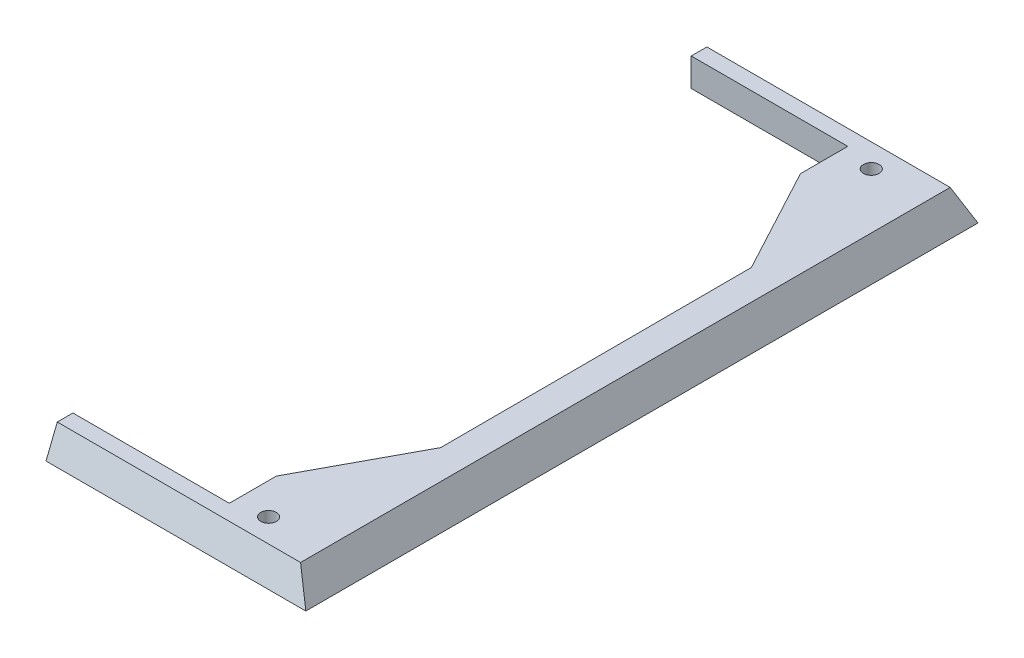
ISO-10303-21;
HEADER;
FILE_DESCRIPTION(('STEP AP214'),'2;1');
FILE_NAME('part.step','',(''),(''),'','','');
FILE_SCHEMA(('AUTOMOTIVE_DESIGN { 1 0 10303 214 1 1 1 1 }'));
ENDSEC;
DATA;
#1=APPLICATION_CONTEXT('core data for automotive mechanical design processes');
#2=APPLICATION_PROTOCOL_DEFINITION('international standard','automotive_design',2000,#1);
#3=PRODUCT_CONTEXT('',#1,'mechanical');
#4=PRODUCT('Part','Part','',(#3));
#5=PRODUCT_RELATED_PRODUCT_CATEGORY('part','',(#4));
#6=PRODUCT_DEFINITION_FORMATION('','',#4);
#7=PRODUCT_DEFINITION_CONTEXT('part definition',#1,'design');
#8=PRODUCT_DEFINITION('design','',#6,#7);
#9=PRODUCT_DEFINITION_SHAPE('','',#8);
#10=(LENGTH_UNIT() NAMED_UNIT(*) SI_UNIT(.MILLI.,.METRE.));
#11=(NAMED_UNIT(*) PLANE_ANGLE_UNIT() SI_UNIT($,.RADIAN.));
#12=(NAMED_UNIT(*) SI_UNIT($,.STERADIAN.) SOLID_ANGLE_UNIT());
#13=UNCERTAINTY_MEASURE_WITH_UNIT(LENGTH_MEASURE(1.E-05),#10,'distance_accuracy_value','');
#14=(GEOMETRIC_REPRESENTATION_CONTEXT(3) GLOBAL_UNCERTAINTY_ASSIGNED_CONTEXT((#13)) GLOBAL_UNIT_ASSIGNED_CONTEXT((#10,
#11,#12)) REPRESENTATION_CONTEXT('',''));
#15=CARTESIAN_POINT('',(0.,0.,0.));
#16=DIRECTION('',(0.,0.,1.));
#17=DIRECTION('',(1.,0.,0.));
#18=AXIS2_PLACEMENT_3D('',#15,#16,#17);
#19=CARTESIAN_POINT('',(12.1850786387237,3.,-36.1277693717595));
#20=DIRECTION('',(1.,0.,0.));
#21=DIRECTION('',(0.,0.,-1.));
#22=AXIS2_PLACEMENT_3D('',#19,#20,#21);
#23=PLANE('',#22);
#24=DIRECTION('',(0.,1.,0.));
#25=VECTOR('',#24,1.);
#26=CARTESIAN_POINT('',(12.1850786387237,15.,-42.1776601239794));
#27=LINE('',#26,#25);
#28=CARTESIAN_POINT('',(12.1850786387237,11.4,-42.1776601239794));
#29=VERTEX_POINT('',#28);
#30=CARTESIAN_POINT('',(12.1850786387237,15.,-42.1776601239794));
#31=VERTEX_POINT('',#30);
#32=EDGE_CURVE('E133',#29,#31,#27,.T.);
#33=ORIENTED_EDGE('',*,*,#32,.F.);
#34=DIRECTION('',(0.,0.,-1.));
#35=VECTOR('',#34,1.);
#36=CARTESIAN_POINT('',(12.1850786387237,11.4,-28.4548897395233));
#37=LINE('',#36,#35);
#38=CARTESIAN_POINT('',(12.1850786387237,11.4,-36.1277693717595));
#39=VERTEX_POINT('',#38);
#40=EDGE_CURVE('E175',#39,#29,#37,.T.);
#41=ORIENTED_EDGE('',*,*,#40,.F.);
#42=DIRECTION('',(0.,1.,0.));
#43=VECTOR('',#42,1.);
#44=CARTESIAN_POINT('',(12.1850786387237,3.,-36.1277693717595));
#45=LINE('',#44,#43);
#46=CARTESIAN_POINT('',(12.1850786387237,15.,-36.1277693717595));
#47=VERTEX_POINT('',#46);
#48=EDGE_CURVE('E182',#39,#47,#45,.T.);
#49=ORIENTED_EDGE('',*,*,#48,.T.);
#50=DIRECTION('',(0.,0.,-1.));
#51=VECTOR('',#50,1.);
#52=CARTESIAN_POINT('',(12.1850786387237,15.,-36.1277693717595));
#53=LINE('',#52,#51);
#54=EDGE_CURVE('E127',#47,#31,#53,.T.);
#55=ORIENTED_EDGE('',*,*,#54,.T.);
#56=EDGE_LOOP('',(#33,#41,#49,#55));
#57=FACE_BOUND('',#56,.T.);
#58=ADVANCED_FACE('F33',(#57),#23,.F.);
#59=CARTESIAN_POINT('',(12.1654237640311,3.,30.8097046992084));
#60=DIRECTION('',(1.,0.,0.));
#61=DIRECTION('',(0.,0.,-1.));
#62=AXIS2_PLACEMENT_3D('',#59,#60,#61);
#63=PLANE('',#62);
#64=DIRECTION('',(0.,0.,-1.));
#65=VECTOR('',#64,1.);
#66=CARTESIAN_POINT('',(12.1654237640311,11.4,23.313034746654));
#67=LINE('',#66,#65);
#68=CARTESIAN_POINT('',(12.1654237640311,11.4,36.8223398760206));
#69=VERTEX_POINT('',#68);
#70=CARTESIAN_POINT('',(12.1654237640311,11.4,30.8097046992084));
#71=VERTEX_POINT('',#70);
#72=EDGE_CURVE('E155',#69,#71,#67,.T.);
#73=ORIENTED_EDGE('',*,*,#72,.F.);
#74=DIRECTION('',(0.,-1.,0.));
#75=VECTOR('',#74,1.);
#76=CARTESIAN_POINT('',(12.1654237640311,15.,36.8223398760206));
#77=LINE('',#76,#75);
#78=CARTESIAN_POINT('',(12.1654237640311,15.,36.8223398760206));
#79=VERTEX_POINT('',#78);
#80=EDGE_CURVE('E139',#79,#69,#77,.T.);
#81=ORIENTED_EDGE('',*,*,#80,.F.);
#82=DIRECTION('',(0.,0.,-1.));
#83=VECTOR('',#82,1.);
#84=CARTESIAN_POINT('',(12.1654237640311,15.,30.8097046992084));
#85=LINE('',#84,#83);
#86=CARTESIAN_POINT('',(12.1654237640311,15.,30.8097046992084));
#87=VERTEX_POINT('',#86);
#88=EDGE_CURVE('E124',#79,#87,#85,.T.);
#89=ORIENTED_EDGE('',*,*,#88,.T.);
#90=DIRECTION('',(0.,1.,0.));
#91=VECTOR('',#90,1.);
#92=CARTESIAN_POINT('',(12.1654237640311,3.,30.8097046992084));
#93=LINE('',#92,#91);
#94=EDGE_CURVE('E101',#71,#87,#93,.T.);
#95=ORIENTED_EDGE('',*,*,#94,.F.);
#96=EDGE_LOOP('',(#73,#81,#89,#95));
#97=FACE_BOUND('',#96,.T.);
#98=ADVANCED_FACE('F221',(#97),#63,.F.);
#99=CARTESIAN_POINT('',(31.4163270772975,1.11973354177883,-55.1776601239794));
#100=DIRECTION('',(-0.862426499786159,-0.506182311491221,0.));
#101=DIRECTION('',(0.506182311491221,-0.862426499786159,0.));
#102=AXIS2_PLACEMENT_3D('',#99,#100,#101);
#103=PLANE('',#102);
#104=DIRECTION('',(0.478509987129761,-0.815278771984898,0.326111508793959));
#105=VECTOR('',#104,1.);
#106=CARTESIAN_POINT('',(15.8814583886596,27.5878303591287,33.7872077323691));
#107=LINE('',#106,#105);
#108=CARTESIAN_POINT('',(23.2696092275114,15.,38.8223398760206));
#109=VERTEX_POINT('',#108);
#110=CARTESIAN_POINT('',(25.3825502396675,11.4,40.2623398760206));
#111=VERTEX_POINT('',#110);
#112=EDGE_CURVE('E136',#109,#111,#107,.T.);
#113=ORIENTED_EDGE('',*,*,#112,.T.);
#114=DIRECTION('',(0.,0.,1.));
#115=VECTOR('',#114,1.);
#116=CARTESIAN_POINT('',(25.3825502396675,11.4,4.82233987602057));
#117=LINE('',#116,#115);
#118=CARTESIAN_POINT('',(25.3825502396675,11.4,-45.6176601239794));
#119=VERTEX_POINT('',#118);
#120=EDGE_CURVE('E50',#119,#111,#117,.T.);
#121=ORIENTED_EDGE('',*,*,#120,.F.);
#122=DIRECTION('',(-0.478509987129761,0.815278771984898,0.326111508793959));
#123=VECTOR('',#122,1.);
#124=CARTESIAN_POINT('',(32.2664578456254,-0.328707634937858,-50.3091431779546));
#125=LINE('',#124,#123);
#126=CARTESIAN_POINT('',(23.2696092275114,15.,-44.1776601239794));
#127=VERTEX_POINT('',#126);
#128=EDGE_CURVE('E126',#119,#127,#125,.T.);
#129=ORIENTED_EDGE('',*,*,#128,.T.);
#130=DIRECTION('',(0.,0.,1.));
#131=VECTOR('',#130,1.);
#132=CARTESIAN_POINT('',(23.2696092275114,15.,-55.1776601239794));
#133=LINE('',#132,#131);
#134=EDGE_CURVE('E149',#127,#109,#133,.T.);
#135=ORIENTED_EDGE('',*,*,#134,.T.);
#136=EDGE_LOOP('',(#113,#121,#129,#135));
#137=FACE_BOUND('',#136,.T.);
#138=ADVANCED_FACE('F242',(#137),#103,.F.);
#139=CARTESIAN_POINT('',(0.,0.,-42.1776601239794));
#140=DIRECTION('',(0.,0.,-1.));
#141=DIRECTION('',(-1.,0.,0.));
#142=AXIS2_PLACEMENT_3D('',#139,#140,#141);
#143=PLANE('',#142);
#144=DIRECTION('',(1.,0.,0.));
#145=VECTOR('',#144,1.);
#146=CARTESIAN_POINT('',(-7.81445427467312,11.4,-42.1776601239794));
#147=LINE('',#146,#145);
#148=CARTESIAN_POINT('',(-7.81445427467312,11.4,-42.1776601239794));
#149=VERTEX_POINT('',#148);
#150=EDGE_CURVE('E132',#149,#29,#147,.T.);
#151=ORIENTED_EDGE('',*,*,#150,.T.);
#152=ORIENTED_EDGE('',*,*,#32,.T.);
#153=DIRECTION('',(-1.,0.,0.));
#154=VECTOR('',#153,1.);
#155=CARTESIAN_POINT('',(7.18554572532688,15.,-42.1776601239794));
#156=LINE('',#155,#154);
#157=CARTESIAN_POINT('',(-7.81445427467312,15.,-42.1776601239794));
#158=VERTEX_POINT('',#157);
#159=EDGE_CURVE('E129',#31,#158,#156,.T.);
#160=ORIENTED_EDGE('',*,*,#159,.T.);
#161=DIRECTION('',(0.,-1.,0.));
#162=VECTOR('',#161,1.);
#163=CARTESIAN_POINT('',(-7.81445427467312,0.,-42.1776601239794));
#164=LINE('',#163,#162);
#165=EDGE_CURVE('E201',#158,#149,#164,.T.);
#166=ORIENTED_EDGE('',*,*,#165,.T.);
#167=EDGE_LOOP('',(#151,#152,#160,#166));
#168=FACE_BOUND('',#167,.T.);
#169=ADVANCED_FACE('F198',(#168),#143,.F.);
#170=CARTESIAN_POINT('',(0.,0.,36.8223398760206));
#171=DIRECTION('',(0.,0.,-1.));
#172=DIRECTION('',(-1.,0.,0.));
#173=AXIS2_PLACEMENT_3D('',#170,#171,#172);
#174=PLANE('',#173);
#175=ORIENTED_EDGE('',*,*,#80,.T.);
#176=DIRECTION('',(-1.,0.,0.));
#177=VECTOR('',#176,1.);
#178=CARTESIAN_POINT('',(-7.81445427467312,11.4,36.8223398760206));
#179=LINE('',#178,#177);
#180=CARTESIAN_POINT('',(-7.81445427467312,11.4,36.8223398760206));
#181=VERTEX_POINT('',#180);
#182=EDGE_CURVE('E140',#69,#181,#179,.T.);
#183=ORIENTED_EDGE('',*,*,#182,.T.);
#184=DIRECTION('',(0.,-1.,0.));
#185=VECTOR('',#184,1.);
#186=CARTESIAN_POINT('',(-7.81445427467312,0.,36.8223398760206));
#187=LINE('',#186,#185);
#188=CARTESIAN_POINT('',(-7.81445427467312,15.,36.8223398760206));
#189=VERTEX_POINT('',#188);
#190=EDGE_CURVE('E59',#189,#181,#187,.T.);
#191=ORIENTED_EDGE('',*,*,#190,.F.);
#192=DIRECTION('',(1.,0.,0.));
#193=VECTOR('',#192,1.);
#194=CARTESIAN_POINT('',(-7.81445427467312,15.,36.8223398760206));
#195=LINE('',#194,#193);
#196=EDGE_CURVE('E143',#189,#79,#195,.T.);
#197=ORIENTED_EDGE('',*,*,#196,.T.);
#198=EDGE_LOOP('',(#175,#183,#191,#197));
#199=FACE_BOUND('',#198,.T.);
#200=ADVANCED_FACE('F230',(#199),#174,.T.);
#201=CARTESIAN_POINT('',(84.3349689328502,0.,-50.1776601239794));
#202=DIRECTION('',(0.,-0.371390676354104,0.928476690885259));
#203=DIRECTION('',(0.,-0.928476690885259,-0.371390676354104));
#204=AXIS2_PLACEMENT_3D('',#201,#202,#203);
#205=PLANE('',#204);
#206=ORIENTED_EDGE('',*,*,#128,.F.);
#207=DIRECTION('',(-1.,0.,0.));
#208=VECTOR('',#207,1.);
#209=CARTESIAN_POINT('',(-7.81445427467312,11.4,-45.6176601239794));
#210=LINE('',#209,#208);
#211=CARTESIAN_POINT('',(-7.81445427467312,11.4,-45.6176601239794));
#212=VERTEX_POINT('',#211);
#213=EDGE_CURVE('E147',#119,#212,#210,.T.);
#214=ORIENTED_EDGE('',*,*,#213,.T.);
#215=DIRECTION('',(0.,0.928476690885259,0.371390676354104));
#216=VECTOR('',#215,1.);
#217=CARTESIAN_POINT('',(-7.81445427467312,0.,-50.1776601239794));
#218=LINE('',#217,#216);
#219=CARTESIAN_POINT('',(-7.81445427467312,15.,-44.1776601239794));
#220=VERTEX_POINT('',#219);
#221=EDGE_CURVE('E249',#212,#220,#218,.T.);
#222=ORIENTED_EDGE('',*,*,#221,.T.);
#223=DIRECTION('',(-1.,0.,0.));
#224=VECTOR('',#223,1.);
#225=CARTESIAN_POINT('',(84.3349689328502,15.,-44.1776601239794));
#226=LINE('',#225,#224);
#227=EDGE_CURVE('E153',#127,#220,#226,.T.);
#228=ORIENTED_EDGE('',*,*,#227,.F.);
#229=EDGE_LOOP('',(#206,#214,#222,#228));
#230=FACE_BOUND('',#229,.T.);
#231=ADVANCED_FACE('F248',(#230),#205,.F.);
#232=CARTESIAN_POINT('',(84.3349689328502,0.,44.8223398760206));
#233=DIRECTION('',(0.,-0.371390676354104,-0.928476690885259));
#234=DIRECTION('',(0.,0.92847669088526,-0.371390676354104));
#235=AXIS2_PLACEMENT_3D('',#232,#233,#234);
#236=PLANE('',#235);
#237=DIRECTION('',(1.,0.,0.));
#238=VECTOR('',#237,1.);
#239=CARTESIAN_POINT('',(-7.81445427467312,11.4,40.2623398760206));
#240=LINE('',#239,#238);
#241=CARTESIAN_POINT('',(-7.81445427467312,11.4,40.2623398760206));
#242=VERTEX_POINT('',#241);
#243=EDGE_CURVE('E113',#242,#111,#240,.T.);
#244=ORIENTED_EDGE('',*,*,#243,.T.);
#245=ORIENTED_EDGE('',*,*,#112,.F.);
#246=DIRECTION('',(-1.,0.,0.));
#247=VECTOR('',#246,1.);
#248=CARTESIAN_POINT('',(84.3349689328502,15.,38.8223398760206));
#249=LINE('',#248,#247);
#250=CARTESIAN_POINT('',(-7.81445427467312,15.,38.8223398760206));
#251=VERTEX_POINT('',#250);
#252=EDGE_CURVE('E152',#109,#251,#249,.T.);
#253=ORIENTED_EDGE('',*,*,#252,.T.);
#254=DIRECTION('',(0.,-0.92847669088526,0.371390676354104));
#255=VECTOR('',#254,1.);
#256=CARTESIAN_POINT('',(-7.81445427467312,0.,44.8223398760206));
#257=LINE('',#256,#255);
#258=EDGE_CURVE('E236',#251,#242,#257,.T.);
#259=ORIENTED_EDGE('',*,*,#258,.T.);
#260=EDGE_LOOP('',(#244,#245,#253,#259));
#261=FACE_BOUND('',#260,.T.);
#262=ADVANCED_FACE('F240',(#261),#236,.F.);
#263=CARTESIAN_POINT('',(19.5106554837796,3.,17.1597213992457));
#264=DIRECTION('',(0.999997779447508,0.,-0.00210739176553417));
#265=DIRECTION('',(-0.00210739176553417,0.,-0.999997779447508));
#266=AXIS2_PLACEMENT_3D('',#263,#264,#265);
#267=PLANE('',#266);
#268=DIRECTION('',(0.,-1.,0.));
#269=VECTOR('',#268,1.);
#270=CARTESIAN_POINT('',(19.4268280734063,15.,-22.6179913170737));
#271=LINE('',#270,#269);
#272=CARTESIAN_POINT('',(19.4268280734063,15.,-22.6179913170737));
#273=VERTEX_POINT('',#272);
#274=CARTESIAN_POINT('',(19.4268280734063,11.4,-22.6179913170737));
#275=VERTEX_POINT('',#274);
#276=EDGE_CURVE('E112',#273,#275,#271,.T.);
#277=ORIENTED_EDGE('',*,*,#276,.T.);
#278=DIRECTION('',(0.00210739176553417,0.,0.999997779447508));
#279=VECTOR('',#278,1.);
#280=CARTESIAN_POINT('',(19.5106554837796,11.4,17.1597213992457));
#281=LINE('',#280,#279);
#282=CARTESIAN_POINT('',(19.5106554837796,11.4,17.1597213992457));
#283=VERTEX_POINT('',#282);
#284=EDGE_CURVE('E96',#275,#283,#281,.T.);
#285=ORIENTED_EDGE('',*,*,#284,.T.);
#286=DIRECTION('',(0.,-1.,0.));
#287=VECTOR('',#286,1.);
#288=CARTESIAN_POINT('',(19.5106554837796,15.,17.1597213992457));
#289=LINE('',#288,#287);
#290=CARTESIAN_POINT('',(19.5106554837796,15.,17.1597213992457));
#291=VERTEX_POINT('',#290);
#292=EDGE_CURVE('E89',#291,#283,#289,.T.);
#293=ORIENTED_EDGE('',*,*,#292,.F.);
#294=DIRECTION('',(-0.00210739176553417,0.,-0.999997779447508));
#295=VECTOR('',#294,1.);
#296=CARTESIAN_POINT('',(19.5106554837796,15.,17.1597213992457));
#297=LINE('',#296,#295);
#298=EDGE_CURVE('E93',#291,#273,#297,.T.);
#299=ORIENTED_EDGE('',*,*,#298,.T.);
#300=EDGE_LOOP('',(#277,#285,#293,#299));
#301=FACE_BOUND('',#300,.T.);
#302=ADVANCED_FACE('F92',(#301),#267,.F.);
#303=CARTESIAN_POINT('',(16.1850786387237,5.,-41.1776601239794));
#304=DIRECTION('',(0.,1.,0.));
#305=DIRECTION('',(0.,0.,1.));
#306=AXIS2_PLACEMENT_3D('',#303,#304,#305);
#307=CYLINDRICAL_SURFACE('',#306,1.);
#308=CARTESIAN_POINT('',(16.1850786387237,11.4,-41.1776601239794));
#309=DIRECTION('',(0.,1.,0.));
#310=DIRECTION('',(0.,0.,1.));
#311=AXIS2_PLACEMENT_3D('',#308,#309,#310);
#312=CIRCLE('',#311,1.);
#313=CARTESIAN_POINT('',(16.1850786387237,11.4,-40.1776601239794));
#314=VERTEX_POINT('',#313);
#315=EDGE_CURVE('E250',#314,#314,#312,.F.);
#316=ORIENTED_EDGE('',*,*,#315,.T.);
#317=EDGE_LOOP('',(#316));
#318=FACE_BOUND('',#317,.T.);
#319=CARTESIAN_POINT('',(16.1850786387237,15.,-41.1776601239794));
#320=DIRECTION('',(0.,1.,0.));
#321=DIRECTION('',(0.,0.,1.));
#322=AXIS2_PLACEMENT_3D('',#319,#320,#321);
#323=CIRCLE('',#322,1.);
#324=CARTESIAN_POINT('',(16.1850786387237,15.,-40.1776601239794));
#325=VERTEX_POINT('',#324);
#326=EDGE_CURVE('E161',#325,#325,#323,.T.);
#327=ORIENTED_EDGE('',*,*,#326,.T.);
#328=EDGE_LOOP('',(#327));
#329=FACE_BOUND('',#328,.T.);
#330=ADVANCED_FACE('F293',(#318,#329),#307,.F.);
#331=CARTESIAN_POINT('',(16.1850786387237,5.,35.8223398760206));
#332=DIRECTION('',(0.,1.,0.));
#333=DIRECTION('',(0.,0.,1.));
#334=AXIS2_PLACEMENT_3D('',#331,#332,#333);
#335=CYLINDRICAL_SURFACE('',#334,1.);
#336=CARTESIAN_POINT('',(16.1850786387237,11.4,35.8223398760206));
#337=DIRECTION('',(0.,1.,0.));
#338=DIRECTION('',(0.,0.,1.));
#339=AXIS2_PLACEMENT_3D('',#336,#337,#338);
#340=CIRCLE('',#339,1.);
#341=CARTESIAN_POINT('',(16.1850786387237,11.4,36.8223398760206));
#342=VERTEX_POINT('',#341);
#343=EDGE_CURVE('E253',#342,#342,#340,.F.);
#344=ORIENTED_EDGE('',*,*,#343,.T.);
#345=EDGE_LOOP('',(#344));
#346=FACE_BOUND('',#345,.T.);
#347=CARTESIAN_POINT('',(16.1850786387237,15.,35.8223398760206));
#348=DIRECTION('',(0.,1.,0.));
#349=DIRECTION('',(0.,0.,1.));
#350=AXIS2_PLACEMENT_3D('',#347,#348,#349);
#351=CIRCLE('',#350,1.);
#352=CARTESIAN_POINT('',(16.1850786387237,15.,36.8223398760206));
#353=VERTEX_POINT('',#352);
#354=EDGE_CURVE('E37',#353,#353,#351,.T.);
#355=ORIENTED_EDGE('',*,*,#354,.T.);
#356=EDGE_LOOP('',(#355));
#357=FACE_BOUND('',#356,.T.);
#358=ADVANCED_FACE('F35',(#346,#357),#335,.F.);
#359=CARTESIAN_POINT('',(12.1654237640311,3.,30.8097046992084));
#360=DIRECTION('',(0.880599233817261,0.,0.473861783013205));
#361=DIRECTION('',(0.473861783013205,0.,-0.880599233817261));
#362=AXIS2_PLACEMENT_3D('',#359,#360,#361);
#363=PLANE('',#362);
#364=ORIENTED_EDGE('',*,*,#292,.T.);
#365=DIRECTION('',(0.473861783013205,0.,-0.880599233817261));
#366=VECTOR('',#365,1.);
#367=CARTESIAN_POINT('',(12.3297869164472,11.4,30.5042610629542));
#368=LINE('',#367,#366);
#369=EDGE_CURVE('E176',#71,#283,#368,.T.);
#370=ORIENTED_EDGE('',*,*,#369,.F.);
#371=ORIENTED_EDGE('',*,*,#94,.T.);
#372=DIRECTION('',(0.473861783013205,0.,-0.880599233817261));
#373=VECTOR('',#372,1.);
#374=CARTESIAN_POINT('',(12.1654237640311,15.,30.8097046992084));
#375=LINE('',#374,#373);
#376=EDGE_CURVE('E109',#87,#291,#375,.T.);
#377=ORIENTED_EDGE('',*,*,#376,.T.);
#378=EDGE_LOOP('',(#364,#370,#371,#377));
#379=FACE_BOUND('',#378,.T.);
#380=ADVANCED_FACE('F116',(#379),#363,.F.);
#381=CARTESIAN_POINT('',(-4.66503106714981,11.4,4.82233987602058));
#382=DIRECTION('',(0.,1.,0.));
#383=DIRECTION('',(0.,0.,1.));
#384=AXIS2_PLACEMENT_3D('',#381,#382,#383);
#385=PLANE('',#384);
#386=ORIENTED_EDGE('',*,*,#120,.T.);
#387=ORIENTED_EDGE('',*,*,#243,.F.);
#388=DIRECTION('',(0.,0.,-1.));
#389=VECTOR('',#388,1.);
#390=CARTESIAN_POINT('',(-7.81445427467312,11.4,53.8223398760206));
#391=LINE('',#390,#389);
#392=EDGE_CURVE('E42',#242,#181,#391,.T.);
#393=ORIENTED_EDGE('',*,*,#392,.T.);
#394=ORIENTED_EDGE('',*,*,#182,.F.);
#395=ORIENTED_EDGE('',*,*,#72,.T.);
#396=ORIENTED_EDGE('',*,*,#369,.T.);
#397=ORIENTED_EDGE('',*,*,#284,.F.);
#398=DIRECTION('',(-0.472442832734478,0.,-0.881361316259014));
#399=VECTOR('',#398,1.);
#400=CARTESIAN_POINT('',(12.4039838673887,11.4,-35.7193927659478));
#401=LINE('',#400,#399);
#402=EDGE_CURVE('E172',#275,#39,#401,.T.);
#403=ORIENTED_EDGE('',*,*,#402,.T.);
#404=ORIENTED_EDGE('',*,*,#40,.T.);
#405=ORIENTED_EDGE('',*,*,#150,.F.);
#406=EDGE_CURVE('E11',#149,#212,#391,.T.);
#407=ORIENTED_EDGE('',*,*,#406,.T.);
#408=ORIENTED_EDGE('',*,*,#213,.F.);
#409=EDGE_LOOP('',(#386,#387,#393,#394,#395,#396,#397,#403,#404,#405,#407,#408));
#410=FACE_BOUND('',#409,.T.);
#411=ORIENTED_EDGE('',*,*,#315,.F.);
#412=EDGE_LOOP('',(#411));
#413=FACE_BOUND('',#412,.T.);
#414=ORIENTED_EDGE('',*,*,#343,.F.);
#415=EDGE_LOOP('',(#414));
#416=FACE_BOUND('',#415,.T.);
#417=ADVANCED_FACE('F225',(#410,#413,#416),#385,.F.);
#418=CARTESIAN_POINT('',(12.1850786387237,3.,-36.1277693717595));
#419=DIRECTION('',(0.881361316259014,0.,-0.472442832734478));
#420=DIRECTION('',(-0.472442832734478,0.,-0.881361316259014));
#421=AXIS2_PLACEMENT_3D('',#418,#419,#420);
#422=PLANE('',#421);
#423=ORIENTED_EDGE('',*,*,#276,.F.);
#424=DIRECTION('',(-0.472442832734478,0.,-0.881361316259014));
#425=VECTOR('',#424,1.);
#426=CARTESIAN_POINT('',(12.1850786387237,15.,-36.1277693717595));
#427=LINE('',#426,#425);
#428=EDGE_CURVE('E111',#273,#47,#427,.T.);
#429=ORIENTED_EDGE('',*,*,#428,.T.);
#430=ORIENTED_EDGE('',*,*,#48,.F.);
#431=ORIENTED_EDGE('',*,*,#402,.F.);
#432=EDGE_LOOP('',(#423,#429,#430,#431));
#433=FACE_BOUND('',#432,.T.);
#434=ADVANCED_FACE('F263',(#433),#422,.F.);
#435=CARTESIAN_POINT('',(-49.6650310671498,15.,-55.1776601239794));
#436=DIRECTION('',(0.,-1.,0.));
#437=DIRECTION('',(0.,0.,-1.));
#438=AXIS2_PLACEMENT_3D('',#435,#436,#437);
#439=PLANE('',#438);
#440=ORIENTED_EDGE('',*,*,#354,.F.);
#441=EDGE_LOOP('',(#440));
#442=FACE_BOUND('',#441,.T.);
#443=ORIENTED_EDGE('',*,*,#326,.F.);
#444=EDGE_LOOP('',(#443));
#445=FACE_BOUND('',#444,.T.);
#446=ORIENTED_EDGE('',*,*,#227,.T.);
#447=DIRECTION('',(0.,0.,1.));
#448=VECTOR('',#447,1.);
#449=CARTESIAN_POINT('',(-7.81445427467312,15.,-55.1776601239794));
#450=LINE('',#449,#448);
#451=EDGE_CURVE('E195',#220,#158,#450,.T.);
#452=ORIENTED_EDGE('',*,*,#451,.T.);
#453=ORIENTED_EDGE('',*,*,#159,.F.);
#454=ORIENTED_EDGE('',*,*,#54,.F.);
#455=ORIENTED_EDGE('',*,*,#428,.F.);
#456=ORIENTED_EDGE('',*,*,#298,.F.);
#457=ORIENTED_EDGE('',*,*,#376,.F.);
#458=ORIENTED_EDGE('',*,*,#88,.F.);
#459=ORIENTED_EDGE('',*,*,#196,.F.);
#460=EDGE_CURVE('E234',#189,#251,#450,.T.);
#461=ORIENTED_EDGE('',*,*,#460,.T.);
#462=ORIENTED_EDGE('',*,*,#252,.F.);
#463=ORIENTED_EDGE('',*,*,#134,.F.);
#464=EDGE_LOOP('',(#446,#452,#453,#454,#455,#456,#457,#458,#459,#461,#462,#463));
#465=FACE_BOUND('',#464,.T.);
#466=ADVANCED_FACE('F107',(#442,#445,#465),#439,.F.);
#467=CARTESIAN_POINT('',(-7.81445427467312,30.,-46.1776601239794));
#468=DIRECTION('',(1.,0.,0.));
#469=DIRECTION('',(0.,0.,-1.));
#470=AXIS2_PLACEMENT_3D('',#467,#468,#469);
#471=PLANE('',#470);
#472=ORIENTED_EDGE('',*,*,#451,.F.);
#473=ORIENTED_EDGE('',*,*,#221,.F.);
#474=ORIENTED_EDGE('',*,*,#406,.F.);
#475=ORIENTED_EDGE('',*,*,#165,.F.);
#476=EDGE_LOOP('',(#472,#473,#474,#475));
#477=FACE_BOUND('',#476,.T.);
#478=ADVANCED_FACE('F334',(#477),#471,.F.);
#479=ORIENTED_EDGE('',*,*,#190,.T.);
#480=ORIENTED_EDGE('',*,*,#392,.F.);
#481=ORIENTED_EDGE('',*,*,#258,.F.);
#482=ORIENTED_EDGE('',*,*,#460,.F.);
#483=EDGE_LOOP('',(#479,#480,#481,#482));
#484=FACE_BOUND('',#483,.T.);
#485=ADVANCED_FACE('F346',(#484),#471,.F.);
#486=CLOSED_SHELL('',(#58,#98,#138,#169,#200,#231,#262,#302,#330,#358,#380,#417,#434,#466,#478,#485));
#487=MANIFOLD_SOLID_BREP('B2',#486);
#488=ADVANCED_BREP_SHAPE_REPRESENTATION('',(#18,#487),#14);
#489=SHAPE_DEFINITION_REPRESENTATION(#9,#488);
ENDSEC;
END-ISO-10303-21;
